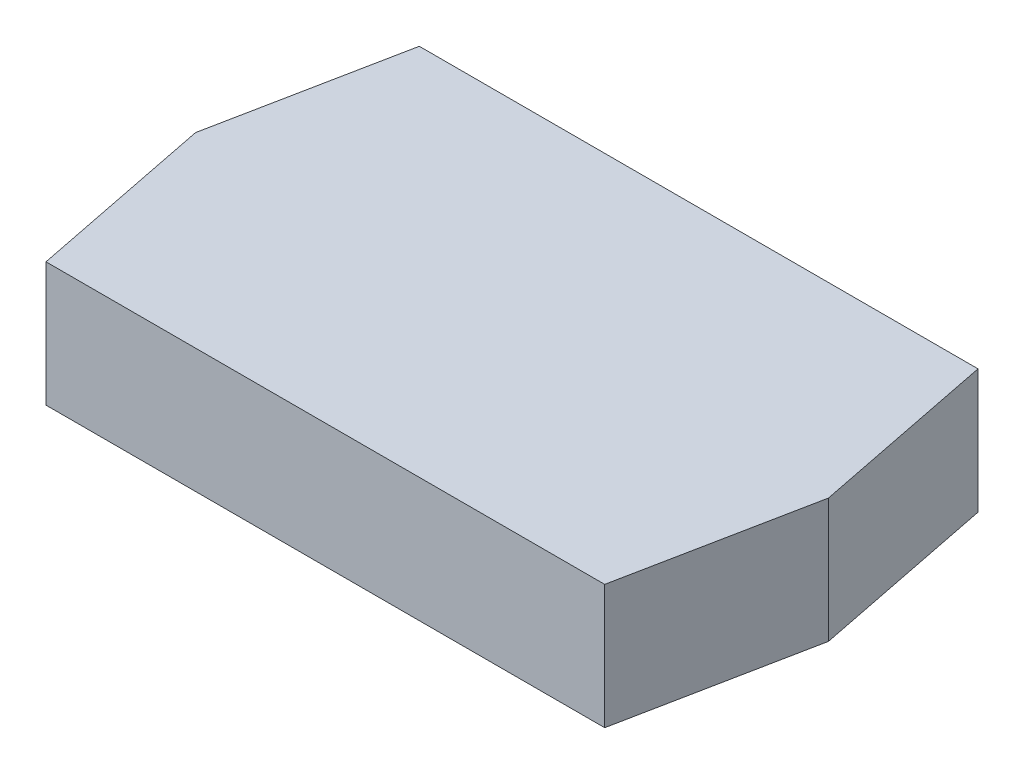
ISO-10303-21;
HEADER;
FILE_DESCRIPTION(('STEP AP214'),'2;1');
FILE_NAME('part.step','',(''),(''),'','','');
FILE_SCHEMA(('AUTOMOTIVE_DESIGN { 1 0 10303 214 1 1 1 1 }'));
ENDSEC;
DATA;
#1=APPLICATION_CONTEXT('core data for automotive mechanical design processes');
#2=APPLICATION_PROTOCOL_DEFINITION('international standard','automotive_design',2000,#1);
#3=PRODUCT_CONTEXT('',#1,'mechanical');
#4=PRODUCT('Part','Part','',(#3));
#5=PRODUCT_RELATED_PRODUCT_CATEGORY('part','',(#4));
#6=PRODUCT_DEFINITION_FORMATION('','',#4);
#7=PRODUCT_DEFINITION_CONTEXT('part definition',#1,'design');
#8=PRODUCT_DEFINITION('design','',#6,#7);
#9=PRODUCT_DEFINITION_SHAPE('','',#8);
#10=(LENGTH_UNIT() NAMED_UNIT(*) SI_UNIT(.MILLI.,.METRE.));
#11=(NAMED_UNIT(*) PLANE_ANGLE_UNIT() SI_UNIT($,.RADIAN.));
#12=(NAMED_UNIT(*) SI_UNIT($,.STERADIAN.) SOLID_ANGLE_UNIT());
#13=UNCERTAINTY_MEASURE_WITH_UNIT(LENGTH_MEASURE(1.E-05),#10,'distance_accuracy_value','');
#14=(GEOMETRIC_REPRESENTATION_CONTEXT(3) GLOBAL_UNCERTAINTY_ASSIGNED_CONTEXT((#13)) GLOBAL_UNIT_ASSIGNED_CONTEXT((#10,
#11,#12)) REPRESENTATION_CONTEXT('',''));
#15=CARTESIAN_POINT('',(0.,0.,0.));
#16=DIRECTION('',(0.,0.,1.));
#17=DIRECTION('',(1.,0.,0.));
#18=AXIS2_PLACEMENT_3D('',#15,#16,#17);
#19=CARTESIAN_POINT('',(22.4994055784104,10.,-15.0336221733761));
#20=DIRECTION('',(0.,0.,1.));
#21=DIRECTION('',(1.,0.,0.));
#22=AXIS2_PLACEMENT_3D('',#19,#20,#21);
#23=PLANE('',#22);
#24=DIRECTION('',(-1.,0.,0.));
#25=VECTOR('',#24,1.);
#26=CARTESIAN_POINT('',(22.4994055784104,0.,-15.0336221733761));
#27=LINE('',#26,#25);
#28=CARTESIAN_POINT('',(22.4994055784104,0.,-15.0336221733761));
#29=VERTEX_POINT('',#28);
#30=CARTESIAN_POINT('',(-22.4994055784104,0.,-15.0336221733761));
#31=VERTEX_POINT('',#30);
#32=EDGE_CURVE('E128',#29,#31,#27,.T.);
#33=ORIENTED_EDGE('',*,*,#32,.T.);
#34=DIRECTION('',(0.,-1.,0.));
#35=VECTOR('',#34,1.);
#36=CARTESIAN_POINT('',(-22.4994055784104,10.,-15.0336221733761));
#37=LINE('',#36,#35);
#38=CARTESIAN_POINT('',(-22.4994055784104,10.,-15.0336221733761));
#39=VERTEX_POINT('',#38);
#40=EDGE_CURVE('E11',#39,#31,#37,.T.);
#41=ORIENTED_EDGE('',*,*,#40,.F.);
#42=DIRECTION('',(-1.,0.,0.));
#43=VECTOR('',#42,1.);
#44=CARTESIAN_POINT('',(22.4994055784104,10.,-15.0336221733761));
#45=LINE('',#44,#43);
#46=CARTESIAN_POINT('',(22.4994055784104,10.,-15.0336221733761));
#47=VERTEX_POINT('',#46);
#48=EDGE_CURVE('E144',#47,#39,#45,.T.);
#49=ORIENTED_EDGE('',*,*,#48,.F.);
#50=DIRECTION('',(0.,-1.,0.));
#51=VECTOR('',#50,1.);
#52=CARTESIAN_POINT('',(22.4994055784104,10.,-15.0336221733761));
#53=LINE('',#52,#51);
#54=EDGE_CURVE('E124',#47,#29,#53,.T.);
#55=ORIENTED_EDGE('',*,*,#54,.T.);
#56=EDGE_LOOP('',(#33,#41,#49,#55));
#57=FACE_BOUND('',#56,.T.);
#58=ADVANCED_FACE('F39',(#57),#23,.F.);
#59=CARTESIAN_POINT('',(-22.4994055784104,10.,-15.0336221733761));
#60=DIRECTION('',(0.98078528040323,0.,0.195090322016129));
#61=DIRECTION('',(0.195090322016129,0.,-0.98078528040323));
#62=AXIS2_PLACEMENT_3D('',#59,#60,#61);
#63=PLANE('',#62);
#64=DIRECTION('',(-0.195090322016129,0.,0.98078528040323));
#65=VECTOR('',#64,1.);
#66=CARTESIAN_POINT('',(-22.4994055784104,0.,-15.0336221733761));
#67=LINE('',#66,#65);
#68=CARTESIAN_POINT('',(-25.489778955208,0.,0.));
#69=VERTEX_POINT('',#68);
#70=EDGE_CURVE('E132',#31,#69,#67,.T.);
#71=ORIENTED_EDGE('',*,*,#70,.T.);
#72=DIRECTION('',(0.,-1.,0.));
#73=VECTOR('',#72,1.);
#74=CARTESIAN_POINT('',(-25.489778955208,10.,0.));
#75=LINE('',#74,#73);
#76=CARTESIAN_POINT('',(-25.489778955208,10.,0.));
#77=VERTEX_POINT('',#76);
#78=EDGE_CURVE('E48',#77,#69,#75,.T.);
#79=ORIENTED_EDGE('',*,*,#78,.F.);
#80=DIRECTION('',(-0.195090322016129,0.,0.98078528040323));
#81=VECTOR('',#80,1.);
#82=CARTESIAN_POINT('',(-22.4994055784104,10.,-15.0336221733761));
#83=LINE('',#82,#81);
#84=EDGE_CURVE('E93',#39,#77,#83,.T.);
#85=ORIENTED_EDGE('',*,*,#84,.F.);
#86=ORIENTED_EDGE('',*,*,#40,.T.);
#87=EDGE_LOOP('',(#71,#79,#85,#86));
#88=FACE_BOUND('',#87,.T.);
#89=ADVANCED_FACE('F172',(#88),#63,.F.);
#90=CARTESIAN_POINT('',(-22.4994055784104,10.,15.0336221733761));
#91=DIRECTION('',(0.98078528040323,0.,-0.195090322016129));
#92=DIRECTION('',(-0.195090322016129,0.,-0.98078528040323));
#93=AXIS2_PLACEMENT_3D('',#90,#91,#92);
#94=PLANE('',#93);
#95=DIRECTION('',(0.195090322016129,0.,0.98078528040323));
#96=VECTOR('',#95,1.);
#97=CARTESIAN_POINT('',(-22.4994055784104,0.,15.0336221733761));
#98=LINE('',#97,#96);
#99=CARTESIAN_POINT('',(-22.4994055784104,0.,15.0336221733761));
#100=VERTEX_POINT('',#99);
#101=EDGE_CURVE('E135',#69,#100,#98,.T.);
#102=ORIENTED_EDGE('',*,*,#101,.T.);
#103=DIRECTION('',(0.,-1.,0.));
#104=VECTOR('',#103,1.);
#105=CARTESIAN_POINT('',(-22.4994055784104,10.,15.0336221733761));
#106=LINE('',#105,#104);
#107=CARTESIAN_POINT('',(-22.4994055784104,10.,15.0336221733761));
#108=VERTEX_POINT('',#107);
#109=EDGE_CURVE('E117',#108,#100,#106,.T.);
#110=ORIENTED_EDGE('',*,*,#109,.F.);
#111=DIRECTION('',(0.195090322016129,0.,0.98078528040323));
#112=VECTOR('',#111,1.);
#113=CARTESIAN_POINT('',(-22.4994055784104,10.,15.0336221733761));
#114=LINE('',#113,#112);
#115=EDGE_CURVE('E106',#77,#108,#114,.T.);
#116=ORIENTED_EDGE('',*,*,#115,.F.);
#117=ORIENTED_EDGE('',*,*,#78,.T.);
#118=EDGE_LOOP('',(#102,#110,#116,#117));
#119=FACE_BOUND('',#118,.T.);
#120=ADVANCED_FACE('F154',(#119),#94,.F.);
#121=CARTESIAN_POINT('',(22.4994055784104,10.,15.0336221733761));
#122=DIRECTION('',(0.,0.,-1.));
#123=DIRECTION('',(-1.,0.,0.));
#124=AXIS2_PLACEMENT_3D('',#121,#122,#123);
#125=PLANE('',#124);
#126=DIRECTION('',(1.,0.,0.));
#127=VECTOR('',#126,1.);
#128=CARTESIAN_POINT('',(22.4994055784104,0.,15.0336221733761));
#129=LINE('',#128,#127);
#130=CARTESIAN_POINT('',(22.4994055784104,0.,15.0336221733761));
#131=VERTEX_POINT('',#130);
#132=EDGE_CURVE('E115',#100,#131,#129,.T.);
#133=ORIENTED_EDGE('',*,*,#132,.T.);
#134=DIRECTION('',(0.,-1.,0.));
#135=VECTOR('',#134,1.);
#136=CARTESIAN_POINT('',(22.4994055784104,10.,15.0336221733761));
#137=LINE('',#136,#135);
#138=CARTESIAN_POINT('',(22.4994055784104,10.,15.0336221733761));
#139=VERTEX_POINT('',#138);
#140=EDGE_CURVE('E112',#139,#131,#137,.T.);
#141=ORIENTED_EDGE('',*,*,#140,.F.);
#142=DIRECTION('',(1.,0.,0.));
#143=VECTOR('',#142,1.);
#144=CARTESIAN_POINT('',(22.4994055784104,10.,15.0336221733761));
#145=LINE('',#144,#143);
#146=EDGE_CURVE('E100',#108,#139,#145,.T.);
#147=ORIENTED_EDGE('',*,*,#146,.F.);
#148=ORIENTED_EDGE('',*,*,#109,.T.);
#149=EDGE_LOOP('',(#133,#141,#147,#148));
#150=FACE_BOUND('',#149,.T.);
#151=ADVANCED_FACE('F113',(#150),#125,.F.);
#152=CARTESIAN_POINT('',(25.489778955208,10.,0.));
#153=DIRECTION('',(-0.98078528040323,0.,-0.195090322016129));
#154=DIRECTION('',(-0.195090322016129,0.,0.98078528040323));
#155=AXIS2_PLACEMENT_3D('',#152,#153,#154);
#156=PLANE('',#155);
#157=DIRECTION('',(0.195090322016129,0.,-0.98078528040323));
#158=VECTOR('',#157,1.);
#159=CARTESIAN_POINT('',(25.489778955208,0.,0.));
#160=LINE('',#159,#158);
#161=CARTESIAN_POINT('',(25.489778955208,0.,0.));
#162=VERTEX_POINT('',#161);
#163=EDGE_CURVE('E79',#131,#162,#160,.T.);
#164=ORIENTED_EDGE('',*,*,#163,.T.);
#165=DIRECTION('',(0.,-1.,0.));
#166=VECTOR('',#165,1.);
#167=CARTESIAN_POINT('',(25.489778955208,10.,0.));
#168=LINE('',#167,#166);
#169=CARTESIAN_POINT('',(25.489778955208,10.,0.));
#170=VERTEX_POINT('',#169);
#171=EDGE_CURVE('E118',#170,#162,#168,.T.);
#172=ORIENTED_EDGE('',*,*,#171,.F.);
#173=DIRECTION('',(0.195090322016129,0.,-0.98078528040323));
#174=VECTOR('',#173,1.);
#175=CARTESIAN_POINT('',(25.489778955208,10.,0.));
#176=LINE('',#175,#174);
#177=EDGE_CURVE('E104',#139,#170,#176,.T.);
#178=ORIENTED_EDGE('',*,*,#177,.F.);
#179=ORIENTED_EDGE('',*,*,#140,.T.);
#180=EDGE_LOOP('',(#164,#172,#178,#179));
#181=FACE_BOUND('',#180,.T.);
#182=ADVANCED_FACE('F120',(#181),#156,.F.);
#183=CARTESIAN_POINT('',(22.4994055784104,10.,-15.0336221733761));
#184=DIRECTION('',(-0.98078528040323,0.,0.195090322016129));
#185=DIRECTION('',(0.195090322016129,0.,0.98078528040323));
#186=AXIS2_PLACEMENT_3D('',#183,#184,#185);
#187=PLANE('',#186);
#188=DIRECTION('',(-0.195090322016129,0.,-0.98078528040323));
#189=VECTOR('',#188,1.);
#190=CARTESIAN_POINT('',(22.4994055784104,0.,-15.0336221733761));
#191=LINE('',#190,#189);
#192=EDGE_CURVE('E85',#162,#29,#191,.T.);
#193=ORIENTED_EDGE('',*,*,#192,.T.);
#194=ORIENTED_EDGE('',*,*,#54,.F.);
#195=DIRECTION('',(-0.195090322016129,0.,-0.98078528040323));
#196=VECTOR('',#195,1.);
#197=CARTESIAN_POINT('',(22.4994055784104,10.,-15.0336221733761));
#198=LINE('',#197,#196);
#199=EDGE_CURVE('E56',#170,#47,#198,.T.);
#200=ORIENTED_EDGE('',*,*,#199,.F.);
#201=ORIENTED_EDGE('',*,*,#171,.T.);
#202=EDGE_LOOP('',(#193,#194,#200,#201));
#203=FACE_BOUND('',#202,.T.);
#204=ADVANCED_FACE('F161',(#203),#187,.F.);
#205=CARTESIAN_POINT('',(0.,10.,0.));
#206=DIRECTION('',(0.,1.,0.));
#207=DIRECTION('',(0.,0.,1.));
#208=AXIS2_PLACEMENT_3D('',#205,#206,#207);
#209=PLANE('',#208);
#210=ORIENTED_EDGE('',*,*,#48,.T.);
#211=ORIENTED_EDGE('',*,*,#84,.T.);
#212=ORIENTED_EDGE('',*,*,#115,.T.);
#213=ORIENTED_EDGE('',*,*,#146,.T.);
#214=ORIENTED_EDGE('',*,*,#177,.T.);
#215=ORIENTED_EDGE('',*,*,#199,.T.);
#216=EDGE_LOOP('',(#210,#211,#212,#213,#214,#215));
#217=FACE_BOUND('',#216,.T.);
#218=ADVANCED_FACE('F102',(#217),#209,.T.);
#219=CARTESIAN_POINT('',(0.,0.,0.));
#220=DIRECTION('',(0.,1.,0.));
#221=DIRECTION('',(0.,0.,1.));
#222=AXIS2_PLACEMENT_3D('',#219,#220,#221);
#223=PLANE('',#222);
#224=ORIENTED_EDGE('',*,*,#32,.F.);
#225=ORIENTED_EDGE('',*,*,#192,.F.);
#226=ORIENTED_EDGE('',*,*,#163,.F.);
#227=ORIENTED_EDGE('',*,*,#132,.F.);
#228=ORIENTED_EDGE('',*,*,#101,.F.);
#229=ORIENTED_EDGE('',*,*,#70,.F.);
#230=EDGE_LOOP('',(#224,#225,#226,#227,#228,#229));
#231=FACE_BOUND('',#230,.T.);
#232=ADVANCED_FACE('F157',(#231),#223,.F.);
#233=CLOSED_SHELL('',(#58,#89,#120,#151,#182,#204,#218,#232));
#234=MANIFOLD_SOLID_BREP('B2',#233);
#235=ADVANCED_BREP_SHAPE_REPRESENTATION('',(#18,#234),#14);
#236=SHAPE_DEFINITION_REPRESENTATION(#9,#235);
ENDSEC;
END-ISO-10303-21;
